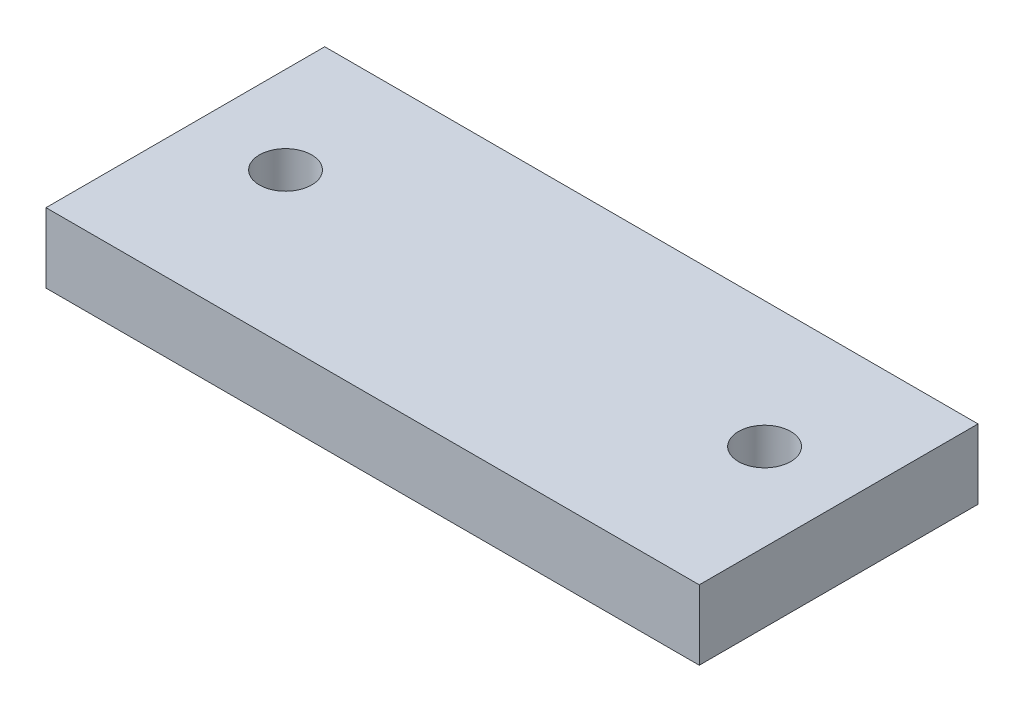
ISO-10303-21;
HEADER;
FILE_DESCRIPTION(('STEP AP214'),'2;1');
FILE_NAME('part.step','',(''),(''),'','','');
FILE_SCHEMA(('AUTOMOTIVE_DESIGN { 1 0 10303 214 1 1 1 1 }'));
ENDSEC;
DATA;
#1=APPLICATION_CONTEXT('core data for automotive mechanical design processes');
#2=APPLICATION_PROTOCOL_DEFINITION('international standard','automotive_design',2000,#1);
#3=PRODUCT_CONTEXT('',#1,'mechanical');
#4=PRODUCT('Part','Part','',(#3));
#5=PRODUCT_RELATED_PRODUCT_CATEGORY('part','',(#4));
#6=PRODUCT_DEFINITION_FORMATION('','',#4);
#7=PRODUCT_DEFINITION_CONTEXT('part definition',#1,'design');
#8=PRODUCT_DEFINITION('design','',#6,#7);
#9=PRODUCT_DEFINITION_SHAPE('','',#8);
#10=(LENGTH_UNIT() NAMED_UNIT(*) SI_UNIT(.MILLI.,.METRE.));
#11=(NAMED_UNIT(*) PLANE_ANGLE_UNIT() SI_UNIT($,.RADIAN.));
#12=(NAMED_UNIT(*) SI_UNIT($,.STERADIAN.) SOLID_ANGLE_UNIT());
#13=UNCERTAINTY_MEASURE_WITH_UNIT(LENGTH_MEASURE(1.E-05),#10,'distance_accuracy_value','');
#14=(GEOMETRIC_REPRESENTATION_CONTEXT(3) GLOBAL_UNCERTAINTY_ASSIGNED_CONTEXT((#13)) GLOBAL_UNIT_ASSIGNED_CONTEXT((#10,
#11,#12)) REPRESENTATION_CONTEXT('',''));
#15=CARTESIAN_POINT('',(0.,0.,0.));
#16=DIRECTION('',(0.,0.,1.));
#17=DIRECTION('',(1.,0.,0.));
#18=AXIS2_PLACEMENT_3D('',#15,#16,#17);
#19=CARTESIAN_POINT('',(7.5,1.6,2.));
#20=DIRECTION('',(-1.,0.,0.));
#21=DIRECTION('',(0.,0.,1.));
#22=AXIS2_PLACEMENT_3D('',#19,#20,#21);
#23=PLANE('',#22);
#24=DIRECTION('',(0.,0.,-1.));
#25=VECTOR('',#24,1.);
#26=CARTESIAN_POINT('',(7.5,0.,2.));
#27=LINE('',#26,#25);
#28=CARTESIAN_POINT('',(7.5,0.,3.5));
#29=VERTEX_POINT('',#28);
#30=CARTESIAN_POINT('',(7.5,0.,-2.9));
#31=VERTEX_POINT('',#30);
#32=EDGE_CURVE('E123',#29,#31,#27,.T.);
#33=ORIENTED_EDGE('',*,*,#32,.T.);
#34=DIRECTION('',(0.,-1.,0.));
#35=VECTOR('',#34,1.);
#36=CARTESIAN_POINT('',(7.5,1.6,-2.9));
#37=LINE('',#36,#35);
#38=CARTESIAN_POINT('',(7.5,1.6,-2.9));
#39=VERTEX_POINT('',#38);
#40=EDGE_CURVE('E92',#39,#31,#37,.T.);
#41=ORIENTED_EDGE('',*,*,#40,.F.);
#42=DIRECTION('',(0.,0.,-1.));
#43=VECTOR('',#42,1.);
#44=CARTESIAN_POINT('',(7.5,1.6,2.));
#45=LINE('',#44,#43);
#46=CARTESIAN_POINT('',(7.5,1.6,3.5));
#47=VERTEX_POINT('',#46);
#48=EDGE_CURVE('E48',#47,#39,#45,.T.);
#49=ORIENTED_EDGE('',*,*,#48,.F.);
#50=DIRECTION('',(0.,1.,0.));
#51=VECTOR('',#50,1.);
#52=CARTESIAN_POINT('',(7.5,1.6,3.5));
#53=LINE('',#52,#51);
#54=EDGE_CURVE('E117',#29,#47,#53,.T.);
#55=ORIENTED_EDGE('',*,*,#54,.F.);
#56=EDGE_LOOP('',(#33,#41,#49,#55));
#57=FACE_BOUND('',#56,.T.);
#58=ADVANCED_FACE('F39',(#57),#23,.F.);
#59=CARTESIAN_POINT('',(-7.5,1.6,2.));
#60=DIRECTION('',(1.,0.,0.));
#61=DIRECTION('',(0.,0.,-1.));
#62=AXIS2_PLACEMENT_3D('',#59,#60,#61);
#63=PLANE('',#62);
#64=DIRECTION('',(0.,0.,1.));
#65=VECTOR('',#64,1.);
#66=CARTESIAN_POINT('',(-7.5,0.,2.));
#67=LINE('',#66,#65);
#68=CARTESIAN_POINT('',(-7.5,0.,-2.9));
#69=VERTEX_POINT('',#68);
#70=CARTESIAN_POINT('',(-7.5,0.,3.5));
#71=VERTEX_POINT('',#70);
#72=EDGE_CURVE('E125',#69,#71,#67,.T.);
#73=ORIENTED_EDGE('',*,*,#72,.T.);
#74=DIRECTION('',(0.,-1.,0.));
#75=VECTOR('',#74,1.);
#76=CARTESIAN_POINT('',(-7.5,1.6,3.5));
#77=LINE('',#76,#75);
#78=CARTESIAN_POINT('',(-7.5,1.6,3.5));
#79=VERTEX_POINT('',#78);
#80=EDGE_CURVE('E85',#79,#71,#77,.T.);
#81=ORIENTED_EDGE('',*,*,#80,.F.);
#82=DIRECTION('',(0.,0.,1.));
#83=VECTOR('',#82,1.);
#84=CARTESIAN_POINT('',(-7.5,1.6,2.));
#85=LINE('',#84,#83);
#86=CARTESIAN_POINT('',(-7.5,1.6,-2.9));
#87=VERTEX_POINT('',#86);
#88=EDGE_CURVE('E11',#87,#79,#85,.T.);
#89=ORIENTED_EDGE('',*,*,#88,.F.);
#90=DIRECTION('',(0.,1.,0.));
#91=VECTOR('',#90,1.);
#92=CARTESIAN_POINT('',(-7.5,1.6,-2.9));
#93=LINE('',#92,#91);
#94=EDGE_CURVE('E83',#69,#87,#93,.T.);
#95=ORIENTED_EDGE('',*,*,#94,.F.);
#96=EDGE_LOOP('',(#73,#81,#89,#95));
#97=FACE_BOUND('',#96,.T.);
#98=ADVANCED_FACE('F81',(#97),#63,.F.);
#99=CARTESIAN_POINT('',(0.,1.6,0.));
#100=DIRECTION('',(0.,-1.,0.));
#101=DIRECTION('',(0.,0.,-1.));
#102=AXIS2_PLACEMENT_3D('',#99,#100,#101);
#103=PLANE('',#102);
#104=CARTESIAN_POINT('',(5.5,1.6,0.));
#105=DIRECTION('',(0.,1.,0.));
#106=DIRECTION('',(0.,0.,1.));
#107=AXIS2_PLACEMENT_3D('',#104,#105,#106);
#108=CIRCLE('',#107,0.6);
#109=CARTESIAN_POINT('',(5.5,1.6,0.6));
#110=VERTEX_POINT('',#109);
#111=EDGE_CURVE('E132',#110,#110,#108,.T.);
#112=ORIENTED_EDGE('',*,*,#111,.F.);
#113=EDGE_LOOP('',(#112));
#114=FACE_BOUND('',#113,.T.);
#115=CARTESIAN_POINT('',(-5.5,1.6,0.));
#116=DIRECTION('',(0.,1.,0.));
#117=DIRECTION('',(0.,0.,-1.));
#118=AXIS2_PLACEMENT_3D('',#115,#116,#117);
#119=CIRCLE('',#118,0.6);
#120=CARTESIAN_POINT('',(-5.5,1.6,-0.6));
#121=VERTEX_POINT('',#120);
#122=EDGE_CURVE('E104',#121,#121,#119,.T.);
#123=ORIENTED_EDGE('',*,*,#122,.F.);
#124=EDGE_LOOP('',(#123));
#125=FACE_BOUND('',#124,.T.);
#126=ORIENTED_EDGE('',*,*,#48,.T.);
#127=DIRECTION('',(1.,0.,0.));
#128=VECTOR('',#127,1.);
#129=CARTESIAN_POINT('',(-7.5,1.6,-2.9));
#130=LINE('',#129,#128);
#131=EDGE_CURVE('E87',#87,#39,#130,.T.);
#132=ORIENTED_EDGE('',*,*,#131,.F.);
#133=ORIENTED_EDGE('',*,*,#88,.T.);
#134=DIRECTION('',(-1.,0.,0.));
#135=VECTOR('',#134,1.);
#136=CARTESIAN_POINT('',(-7.5,1.6,3.5));
#137=LINE('',#136,#135);
#138=EDGE_CURVE('E120',#47,#79,#137,.T.);
#139=ORIENTED_EDGE('',*,*,#138,.F.);
#140=EDGE_LOOP('',(#126,#132,#133,#139));
#141=FACE_BOUND('',#140,.T.);
#142=ADVANCED_FACE('F88',(#114,#125,#141),#103,.F.);
#143=CARTESIAN_POINT('',(0.,0.,0.));
#144=DIRECTION('',(0.,-1.,0.));
#145=DIRECTION('',(0.,0.,-1.));
#146=AXIS2_PLACEMENT_3D('',#143,#144,#145);
#147=PLANE('',#146);
#148=CARTESIAN_POINT('',(5.5,0.,0.));
#149=DIRECTION('',(0.,-1.,0.));
#150=DIRECTION('',(0.,0.,-1.));
#151=AXIS2_PLACEMENT_3D('',#148,#149,#150);
#152=CIRCLE('',#151,0.6);
#153=CARTESIAN_POINT('',(5.5,0.,-0.6));
#154=VERTEX_POINT('',#153);
#155=EDGE_CURVE('E42',#154,#154,#152,.T.);
#156=ORIENTED_EDGE('',*,*,#155,.F.);
#157=EDGE_LOOP('',(#156));
#158=FACE_BOUND('',#157,.T.);
#159=CARTESIAN_POINT('',(-5.5,0.,0.));
#160=DIRECTION('',(0.,-1.,0.));
#161=DIRECTION('',(0.,0.,-1.));
#162=AXIS2_PLACEMENT_3D('',#159,#160,#161);
#163=CIRCLE('',#162,0.6);
#164=CARTESIAN_POINT('',(-5.5,0.,-0.6));
#165=VERTEX_POINT('',#164);
#166=EDGE_CURVE('E102',#165,#165,#163,.T.);
#167=ORIENTED_EDGE('',*,*,#166,.F.);
#168=EDGE_LOOP('',(#167));
#169=FACE_BOUND('',#168,.T.);
#170=ORIENTED_EDGE('',*,*,#32,.F.);
#171=DIRECTION('',(1.,0.,0.));
#172=VECTOR('',#171,1.);
#173=CARTESIAN_POINT('',(-7.5,0.,3.5));
#174=LINE('',#173,#172);
#175=EDGE_CURVE('E113',#71,#29,#174,.T.);
#176=ORIENTED_EDGE('',*,*,#175,.F.);
#177=ORIENTED_EDGE('',*,*,#72,.F.);
#178=DIRECTION('',(-1.,0.,0.));
#179=VECTOR('',#178,1.);
#180=CARTESIAN_POINT('',(-7.5,0.,-2.9));
#181=LINE('',#180,#179);
#182=EDGE_CURVE('E97',#31,#69,#181,.T.);
#183=ORIENTED_EDGE('',*,*,#182,.F.);
#184=EDGE_LOOP('',(#170,#176,#177,#183));
#185=FACE_BOUND('',#184,.T.);
#186=ADVANCED_FACE('F146',(#158,#169,#185),#147,.T.);
#187=CARTESIAN_POINT('',(0.,0.,3.5));
#188=DIRECTION('',(0.,0.,1.));
#189=DIRECTION('',(1.,0.,0.));
#190=AXIS2_PLACEMENT_3D('',#187,#188,#189);
#191=PLANE('',#190);
#192=ORIENTED_EDGE('',*,*,#80,.T.);
#193=ORIENTED_EDGE('',*,*,#175,.T.);
#194=ORIENTED_EDGE('',*,*,#54,.T.);
#195=ORIENTED_EDGE('',*,*,#138,.T.);
#196=EDGE_LOOP('',(#192,#193,#194,#195));
#197=FACE_BOUND('',#196,.T.);
#198=ADVANCED_FACE('F153',(#197),#191,.T.);
#199=CARTESIAN_POINT('',(0.,0.,-2.9));
#200=DIRECTION('',(0.,0.,1.));
#201=DIRECTION('',(1.,0.,0.));
#202=AXIS2_PLACEMENT_3D('',#199,#200,#201);
#203=PLANE('',#202);
#204=ORIENTED_EDGE('',*,*,#94,.T.);
#205=ORIENTED_EDGE('',*,*,#131,.T.);
#206=ORIENTED_EDGE('',*,*,#40,.T.);
#207=ORIENTED_EDGE('',*,*,#182,.T.);
#208=EDGE_LOOP('',(#204,#205,#206,#207));
#209=FACE_BOUND('',#208,.T.);
#210=ADVANCED_FACE('F95',(#209),#203,.F.);
#211=CARTESIAN_POINT('',(-5.5,-8.4,0.));
#212=DIRECTION('',(0.,1.,0.));
#213=DIRECTION('',(0.,0.,1.));
#214=AXIS2_PLACEMENT_3D('',#211,#212,#213);
#215=CYLINDRICAL_SURFACE('',#214,0.6);
#216=ORIENTED_EDGE('',*,*,#166,.T.);
#217=EDGE_LOOP('',(#216));
#218=FACE_BOUND('',#217,.T.);
#219=ORIENTED_EDGE('',*,*,#122,.T.);
#220=EDGE_LOOP('',(#219));
#221=FACE_BOUND('',#220,.T.);
#222=ADVANCED_FACE('F143',(#218,#221),#215,.F.);
#223=CARTESIAN_POINT('',(5.5,-8.4,0.));
#224=DIRECTION('',(0.,1.,0.));
#225=DIRECTION('',(0.,0.,1.));
#226=AXIS2_PLACEMENT_3D('',#223,#224,#225);
#227=CYLINDRICAL_SURFACE('',#226,0.6);
#228=ORIENTED_EDGE('',*,*,#155,.T.);
#229=EDGE_LOOP('',(#228));
#230=FACE_BOUND('',#229,.T.);
#231=ORIENTED_EDGE('',*,*,#111,.T.);
#232=EDGE_LOOP('',(#231));
#233=FACE_BOUND('',#232,.T.);
#234=ADVANCED_FACE('F171',(#230,#233),#227,.F.);
#235=CLOSED_SHELL('',(#58,#98,#142,#186,#198,#210,#222,#234));
#236=MANIFOLD_SOLID_BREP('B2',#235);
#237=ADVANCED_BREP_SHAPE_REPRESENTATION('',(#18,#236),#14);
#238=SHAPE_DEFINITION_REPRESENTATION(#9,#237);
ENDSEC;
END-ISO-10303-21;
